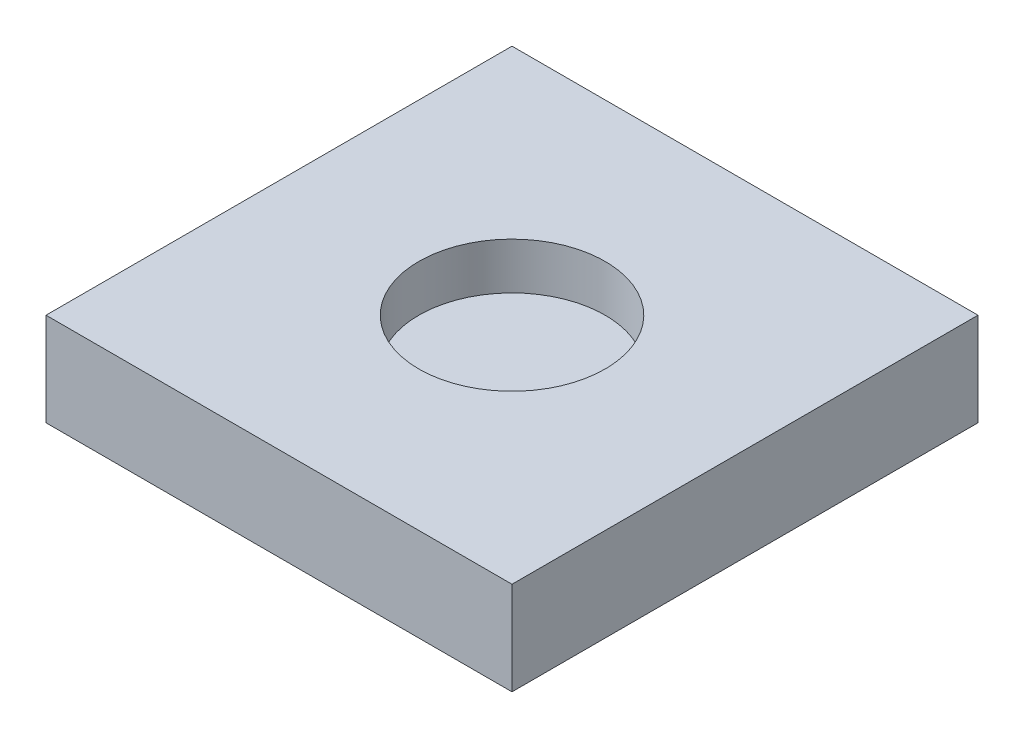
ISO-10303-21;
HEADER;
FILE_DESCRIPTION(('STEP AP214'),'2;1');
FILE_NAME('part.step','',(''),(''),'','','');
FILE_SCHEMA(('AUTOMOTIVE_DESIGN { 1 0 10303 214 1 1 1 1 }'));
ENDSEC;
DATA;
#1=APPLICATION_CONTEXT('core data for automotive mechanical design processes');
#2=APPLICATION_PROTOCOL_DEFINITION('international standard','automotive_design',2000,#1);
#3=PRODUCT_CONTEXT('',#1,'mechanical');
#4=PRODUCT('Part','Part','',(#3));
#5=PRODUCT_RELATED_PRODUCT_CATEGORY('part','',(#4));
#6=PRODUCT_DEFINITION_FORMATION('','',#4);
#7=PRODUCT_DEFINITION_CONTEXT('part definition',#1,'design');
#8=PRODUCT_DEFINITION('design','',#6,#7);
#9=PRODUCT_DEFINITION_SHAPE('','',#8);
#10=(LENGTH_UNIT() NAMED_UNIT(*) SI_UNIT(.MILLI.,.METRE.));
#11=(NAMED_UNIT(*) PLANE_ANGLE_UNIT() SI_UNIT($,.RADIAN.));
#12=(NAMED_UNIT(*) SI_UNIT($,.STERADIAN.) SOLID_ANGLE_UNIT());
#13=UNCERTAINTY_MEASURE_WITH_UNIT(LENGTH_MEASURE(1.E-05),#10,'distance_accuracy_value','');
#14=(GEOMETRIC_REPRESENTATION_CONTEXT(3) GLOBAL_UNCERTAINTY_ASSIGNED_CONTEXT((#13)) GLOBAL_UNIT_ASSIGNED_CONTEXT((#10,
#11,#12)) REPRESENTATION_CONTEXT('',''));
#15=CARTESIAN_POINT('',(0.,0.,0.));
#16=DIRECTION('',(0.,0.,1.));
#17=DIRECTION('',(1.,0.,0.));
#18=AXIS2_PLACEMENT_3D('',#15,#16,#17);
#19=CARTESIAN_POINT('',(250.,-50.,250.));
#20=DIRECTION('',(-1.,0.,0.));
#21=DIRECTION('',(0.,0.,1.));
#22=AXIS2_PLACEMENT_3D('',#19,#20,#21);
#23=PLANE('',#22);
#24=DIRECTION('',(0.,1.,0.));
#25=VECTOR('',#24,1.);
#26=CARTESIAN_POINT('',(250.,-50.,-250.));
#27=LINE('',#26,#25);
#28=CARTESIAN_POINT('',(250.,-50.,-250.));
#29=VERTEX_POINT('',#28);
#30=CARTESIAN_POINT('',(250.,50.,-250.));
#31=VERTEX_POINT('',#30);
#32=EDGE_CURVE('E98',#29,#31,#27,.T.);
#33=ORIENTED_EDGE('',*,*,#32,.T.);
#34=DIRECTION('',(0.,0.,-1.));
#35=VECTOR('',#34,1.);
#36=CARTESIAN_POINT('',(250.,50.,250.));
#37=LINE('',#36,#35);
#38=CARTESIAN_POINT('',(250.,50.,250.));
#39=VERTEX_POINT('',#38);
#40=EDGE_CURVE('E11',#39,#31,#37,.T.);
#41=ORIENTED_EDGE('',*,*,#40,.F.);
#42=DIRECTION('',(0.,1.,0.));
#43=VECTOR('',#42,1.);
#44=CARTESIAN_POINT('',(250.,-50.,250.));
#45=LINE('',#44,#43);
#46=CARTESIAN_POINT('',(250.,-50.,250.));
#47=VERTEX_POINT('',#46);
#48=EDGE_CURVE('E86',#47,#39,#45,.T.);
#49=ORIENTED_EDGE('',*,*,#48,.F.);
#50=DIRECTION('',(0.,0.,-1.));
#51=VECTOR('',#50,1.);
#52=CARTESIAN_POINT('',(250.,-50.,250.));
#53=LINE('',#52,#51);
#54=EDGE_CURVE('E94',#47,#29,#53,.T.);
#55=ORIENTED_EDGE('',*,*,#54,.T.);
#56=EDGE_LOOP('',(#33,#41,#49,#55));
#57=FACE_BOUND('',#56,.T.);
#58=ADVANCED_FACE('F35',(#57),#23,.F.);
#59=CARTESIAN_POINT('',(-250.,50.,250.));
#60=DIRECTION('',(0.,-1.,0.));
#61=DIRECTION('',(0.,0.,-1.));
#62=AXIS2_PLACEMENT_3D('',#59,#60,#61);
#63=PLANE('',#62);
#64=CARTESIAN_POINT('',(0.,50.,0.));
#65=DIRECTION('',(0.,1.,0.));
#66=DIRECTION('',(0.,0.,1.));
#67=AXIS2_PLACEMENT_3D('',#64,#65,#66);
#68=CIRCLE('',#67,100.);
#69=CARTESIAN_POINT('',(0.,50.,100.));
#70=VERTEX_POINT('',#69);
#71=EDGE_CURVE('E112',#70,#70,#68,.T.);
#72=ORIENTED_EDGE('',*,*,#71,.F.);
#73=EDGE_LOOP('',(#72));
#74=FACE_BOUND('',#73,.T.);
#75=DIRECTION('',(-1.,0.,0.));
#76=VECTOR('',#75,1.);
#77=CARTESIAN_POINT('',(-250.,50.,-250.));
#78=LINE('',#77,#76);
#79=CARTESIAN_POINT('',(-250.,50.,-250.));
#80=VERTEX_POINT('',#79);
#81=EDGE_CURVE('E90',#31,#80,#78,.T.);
#82=ORIENTED_EDGE('',*,*,#81,.T.);
#83=DIRECTION('',(0.,0.,-1.));
#84=VECTOR('',#83,1.);
#85=CARTESIAN_POINT('',(-250.,50.,250.));
#86=LINE('',#85,#84);
#87=CARTESIAN_POINT('',(-250.,50.,250.));
#88=VERTEX_POINT('',#87);
#89=EDGE_CURVE('E43',#88,#80,#86,.T.);
#90=ORIENTED_EDGE('',*,*,#89,.F.);
#91=DIRECTION('',(-1.,0.,0.));
#92=VECTOR('',#91,1.);
#93=CARTESIAN_POINT('',(-250.,50.,250.));
#94=LINE('',#93,#92);
#95=EDGE_CURVE('E81',#39,#88,#94,.T.);
#96=ORIENTED_EDGE('',*,*,#95,.F.);
#97=ORIENTED_EDGE('',*,*,#40,.T.);
#98=EDGE_LOOP('',(#82,#90,#96,#97));
#99=FACE_BOUND('',#98,.T.);
#100=ADVANCED_FACE('F89',(#74,#99),#63,.F.);
#101=CARTESIAN_POINT('',(-250.,-50.,250.));
#102=DIRECTION('',(1.,0.,0.));
#103=DIRECTION('',(0.,0.,-1.));
#104=AXIS2_PLACEMENT_3D('',#101,#102,#103);
#105=PLANE('',#104);
#106=DIRECTION('',(0.,-1.,0.));
#107=VECTOR('',#106,1.);
#108=CARTESIAN_POINT('',(-250.,-50.,-250.));
#109=LINE('',#108,#107);
#110=CARTESIAN_POINT('',(-250.,-50.,-250.));
#111=VERTEX_POINT('',#110);
#112=EDGE_CURVE('E68',#80,#111,#109,.T.);
#113=ORIENTED_EDGE('',*,*,#112,.T.);
#114=DIRECTION('',(0.,0.,-1.));
#115=VECTOR('',#114,1.);
#116=CARTESIAN_POINT('',(-250.,-50.,250.));
#117=LINE('',#116,#115);
#118=CARTESIAN_POINT('',(-250.,-50.,250.));
#119=VERTEX_POINT('',#118);
#120=EDGE_CURVE('E91',#119,#111,#117,.T.);
#121=ORIENTED_EDGE('',*,*,#120,.F.);
#122=DIRECTION('',(0.,-1.,0.));
#123=VECTOR('',#122,1.);
#124=CARTESIAN_POINT('',(-250.,-50.,250.));
#125=LINE('',#124,#123);
#126=EDGE_CURVE('E84',#88,#119,#125,.T.);
#127=ORIENTED_EDGE('',*,*,#126,.F.);
#128=ORIENTED_EDGE('',*,*,#89,.T.);
#129=EDGE_LOOP('',(#113,#121,#127,#128));
#130=FACE_BOUND('',#129,.T.);
#131=ADVANCED_FACE('F92',(#130),#105,.F.);
#132=CARTESIAN_POINT('',(-250.,-50.,250.));
#133=DIRECTION('',(0.,1.,0.));
#134=DIRECTION('',(0.,0.,1.));
#135=AXIS2_PLACEMENT_3D('',#132,#133,#134);
#136=PLANE('',#135);
#137=DIRECTION('',(1.,0.,0.));
#138=VECTOR('',#137,1.);
#139=CARTESIAN_POINT('',(-250.,-50.,-250.));
#140=LINE('',#139,#138);
#141=EDGE_CURVE('E74',#111,#29,#140,.T.);
#142=ORIENTED_EDGE('',*,*,#141,.T.);
#143=ORIENTED_EDGE('',*,*,#54,.F.);
#144=DIRECTION('',(1.,0.,0.));
#145=VECTOR('',#144,1.);
#146=CARTESIAN_POINT('',(-250.,-50.,250.));
#147=LINE('',#146,#145);
#148=EDGE_CURVE('E51',#119,#47,#147,.T.);
#149=ORIENTED_EDGE('',*,*,#148,.F.);
#150=ORIENTED_EDGE('',*,*,#120,.T.);
#151=EDGE_LOOP('',(#142,#143,#149,#150));
#152=FACE_BOUND('',#151,.T.);
#153=ADVANCED_FACE('F106',(#152),#136,.F.);
#154=CARTESIAN_POINT('',(0.,0.,250.));
#155=DIRECTION('',(0.,0.,-1.));
#156=DIRECTION('',(-1.,0.,0.));
#157=AXIS2_PLACEMENT_3D('',#154,#155,#156);
#158=PLANE('',#157);
#159=ORIENTED_EDGE('',*,*,#48,.T.);
#160=ORIENTED_EDGE('',*,*,#95,.T.);
#161=ORIENTED_EDGE('',*,*,#126,.T.);
#162=ORIENTED_EDGE('',*,*,#148,.T.);
#163=EDGE_LOOP('',(#159,#160,#161,#162));
#164=FACE_BOUND('',#163,.T.);
#165=ADVANCED_FACE('F82',(#164),#158,.F.);
#166=CARTESIAN_POINT('',(0.,0.,-250.));
#167=DIRECTION('',(0.,0.,-1.));
#168=DIRECTION('',(-1.,0.,0.));
#169=AXIS2_PLACEMENT_3D('',#166,#167,#168);
#170=PLANE('',#169);
#171=ORIENTED_EDGE('',*,*,#32,.F.);
#172=ORIENTED_EDGE('',*,*,#141,.F.);
#173=ORIENTED_EDGE('',*,*,#112,.F.);
#174=ORIENTED_EDGE('',*,*,#81,.F.);
#175=EDGE_LOOP('',(#171,#172,#173,#174));
#176=FACE_BOUND('',#175,.T.);
#177=ADVANCED_FACE('F109',(#176),#170,.T.);
#178=CARTESIAN_POINT('',(0.,0.,0.));
#179=DIRECTION('',(0.,1.,0.));
#180=DIRECTION('',(0.,0.,1.));
#181=AXIS2_PLACEMENT_3D('',#178,#179,#180);
#182=CYLINDRICAL_SURFACE('',#181,100.);
#183=CARTESIAN_POINT('',(0.,0.,0.));
#184=DIRECTION('',(0.,1.,0.));
#185=DIRECTION('',(0.,0.,1.));
#186=AXIS2_PLACEMENT_3D('',#183,#184,#185);
#187=CIRCLE('',#186,100.);
#188=CARTESIAN_POINT('',(0.,0.,100.));
#189=VERTEX_POINT('',#188);
#190=EDGE_CURVE('E101',#189,#189,#187,.T.);
#191=ORIENTED_EDGE('',*,*,#190,.F.);
#192=EDGE_LOOP('',(#191));
#193=FACE_BOUND('',#192,.T.);
#194=ORIENTED_EDGE('',*,*,#71,.T.);
#195=EDGE_LOOP('',(#194));
#196=FACE_BOUND('',#195,.T.);
#197=ADVANCED_FACE('F120',(#193,#196),#182,.F.);
#198=CARTESIAN_POINT('',(0.,0.,0.));
#199=DIRECTION('',(0.,1.,0.));
#200=DIRECTION('',(0.,0.,1.));
#201=AXIS2_PLACEMENT_3D('',#198,#199,#200);
#202=PLANE('',#201);
#203=ORIENTED_EDGE('',*,*,#190,.T.);
#204=EDGE_LOOP('',(#203));
#205=FACE_BOUND('',#204,.T.);
#206=ADVANCED_FACE('F118',(#205),#202,.T.);
#207=CLOSED_SHELL('',(#58,#100,#131,#153,#165,#177,#197,#206));
#208=MANIFOLD_SOLID_BREP('B2',#207);
#209=ADVANCED_BREP_SHAPE_REPRESENTATION('',(#18,#208),#14);
#210=SHAPE_DEFINITION_REPRESENTATION(#9,#209);
ENDSEC;
END-ISO-10303-21;
